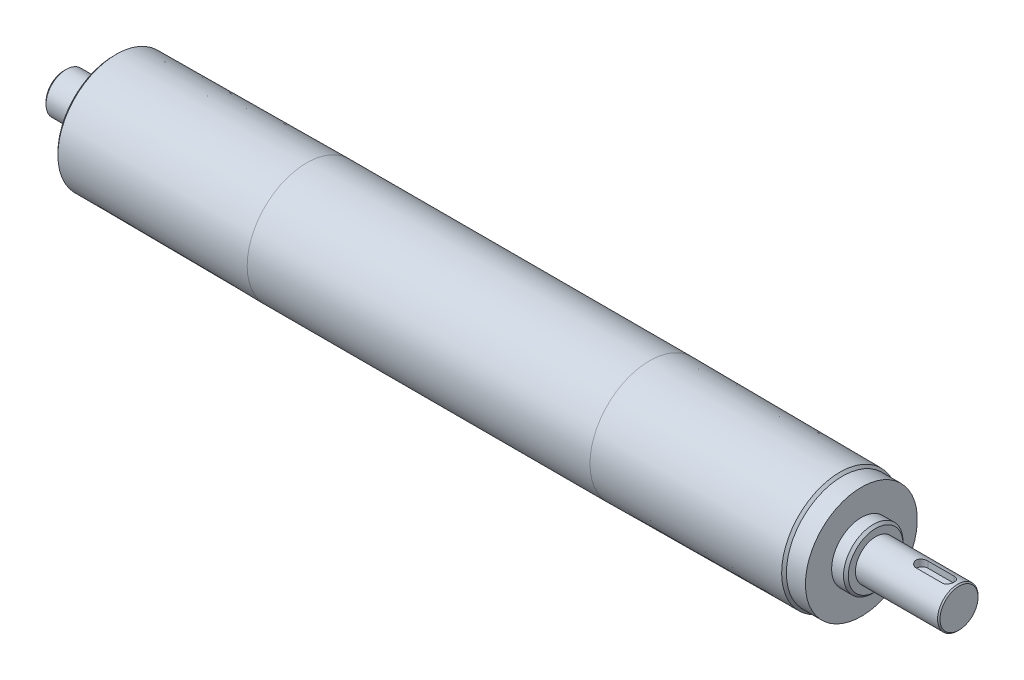
ISO-10303-21;
HEADER;
FILE_DESCRIPTION(('STEP AP214'),'2;1');
FILE_NAME('part.step','',(''),(''),'','','');
FILE_SCHEMA(('AUTOMOTIVE_DESIGN { 1 0 10303 214 1 1 1 1 }'));
ENDSEC;
DATA;
#1=APPLICATION_CONTEXT('core data for automotive mechanical design processes');
#2=APPLICATION_PROTOCOL_DEFINITION('international standard','automotive_design',2000,#1);
#3=PRODUCT_CONTEXT('',#1,'mechanical');
#4=PRODUCT('Part','Part','',(#3));
#5=PRODUCT_RELATED_PRODUCT_CATEGORY('part','',(#4));
#6=PRODUCT_DEFINITION_FORMATION('','',#4);
#7=PRODUCT_DEFINITION_CONTEXT('part definition',#1,'design');
#8=PRODUCT_DEFINITION('design','',#6,#7);
#9=PRODUCT_DEFINITION_SHAPE('','',#8);
#10=(LENGTH_UNIT() NAMED_UNIT(*) SI_UNIT(.MILLI.,.METRE.));
#11=(NAMED_UNIT(*) PLANE_ANGLE_UNIT() SI_UNIT($,.RADIAN.));
#12=(NAMED_UNIT(*) SI_UNIT($,.STERADIAN.) SOLID_ANGLE_UNIT());
#13=UNCERTAINTY_MEASURE_WITH_UNIT(LENGTH_MEASURE(1.E-05),#10,'distance_accuracy_value','');
#14=(GEOMETRIC_REPRESENTATION_CONTEXT(3) GLOBAL_UNCERTAINTY_ASSIGNED_CONTEXT((#13)) GLOBAL_UNIT_ASSIGNED_CONTEXT((#10,
#11,#12)) REPRESENTATION_CONTEXT('',''));
#15=CARTESIAN_POINT('',(0.,0.,0.));
#16=DIRECTION('',(0.,0.,1.));
#17=DIRECTION('',(1.,0.,0.));
#18=AXIS2_PLACEMENT_3D('',#15,#16,#17);
#19=CARTESIAN_POINT('',(-174.,0.,0.));
#20=DIRECTION('',(-1.,0.,0.));
#21=DIRECTION('',(0.,0.,1.));
#22=AXIS2_PLACEMENT_3D('',#19,#20,#21);
#23=CYLINDRICAL_SURFACE('',#22,8.5);
#24=CARTESIAN_POINT('',(201.5,0.,0.));
#25=DIRECTION('',(-1.,0.,0.));
#26=DIRECTION('',(0.,0.,1.));
#27=AXIS2_PLACEMENT_3D('',#24,#25,#26);
#28=CIRCLE('',#27,8.5);
#29=CARTESIAN_POINT('',(201.5,0.,8.5));
#30=VERTEX_POINT('',#29);
#31=EDGE_CURVE('E129',#30,#30,#28,.T.);
#32=ORIENTED_EDGE('',*,*,#31,.T.);
#33=EDGE_LOOP('',(#32));
#34=FACE_BOUND('',#33,.T.);
#35=CARTESIAN_POINT('',(167.,0.,0.));
#36=DIRECTION('',(-1.,0.,0.));
#37=DIRECTION('',(0.,0.,1.));
#38=AXIS2_PLACEMENT_3D('',#35,#36,#37);
#39=CIRCLE('',#38,8.5);
#40=CARTESIAN_POINT('',(167.,0.,8.5));
#41=VERTEX_POINT('',#40);
#42=EDGE_CURVE('E126',#41,#41,#39,.T.);
#43=ORIENTED_EDGE('',*,*,#42,.F.);
#44=EDGE_LOOP('',(#43));
#45=FACE_BOUND('',#44,.T.);
#46=CARTESIAN_POINT('',(186.5,8.12403840463596,-2.5));
#47=CARTESIAN_POINT('',(186.431320125984,8.12402906918787,-2.50000849482375));
#48=CARTESIAN_POINT('',(186.362645644966,8.12490911076693,-2.49717000278527));
#49=CARTESIAN_POINT('',(186.22581945585,8.12837858671625,-2.48586511968106));
#50=CARTESIAN_POINT('',(186.157667637307,8.13096764928693,-2.47739995270244));
#51=CARTESIAN_POINT('',(186.022534814754,8.13777747849977,-2.45493539721691));
#52=CARTESIAN_POINT('',(185.955551343683,8.14199421689239,-2.44094966934029));
#53=CARTESIAN_POINT('',(185.823073877509,8.15192355487623,-2.40758038109889));
#54=CARTESIAN_POINT('',(185.757579918998,8.15763619117327,-2.38819668828001));
#55=CARTESIAN_POINT('',(185.564053342284,8.17677139859334,-2.32218333516284));
#56=CARTESIAN_POINT('',(185.438808855627,8.19220032894026,-2.26766331260792));
#57=CARTESIAN_POINT('',(185.199247499771,8.22665400749432,-2.13928827038699));
#58=CARTESIAN_POINT('',(185.084935474627,8.24568033865687,-2.06542473351159));
#59=CARTESIAN_POINT('',(184.866977246359,8.28582980304435,-1.89805567552887));
#60=CARTESIAN_POINT('',(184.763708544243,8.30699606932741,-1.80406793699747));
#61=CARTESIAN_POINT('',(184.574148769132,8.3486723067775,-1.60015164255656));
#62=CARTESIAN_POINT('',(184.487860541848,8.36918216745792,-1.4902204200766));
#63=CARTESIAN_POINT('',(184.333070185537,8.40772509439061,-1.25484557022576));
#64=CARTESIAN_POINT('',(184.264954141379,8.4257010652051,-1.12913784642327));
#65=CARTESIAN_POINT('',(184.150978008424,8.45664705558545,-0.867439712870076));
#66=CARTESIAN_POINT('',(184.105112355001,8.46961832661637,-0.731451883926542));
#67=CARTESIAN_POINT('',(184.038187402419,8.48878775104764,-0.45702543604255));
#68=CARTESIAN_POINT('',(184.016479434077,8.49516267663223,-0.318757581047526));
#69=CARTESIAN_POINT('',(183.996436833058,8.50104290465192,-0.0404023337326379));
#70=CARTESIAN_POINT('',(183.998097964227,8.50054945212903,0.0996847242177701));
#71=CARTESIAN_POINT('',(184.024307927384,8.49287404903277,0.373152065700674));
#72=CARTESIAN_POINT('',(184.048154187553,8.48589741931878,0.506606351501265));
#73=CARTESIAN_POINT('',(184.116911871628,8.46628787386659,0.767526211609376));
#74=CARTESIAN_POINT('',(184.161824383513,8.45365466599277,0.894991476236457));
#75=CARTESIAN_POINT('',(184.271927116914,8.42386367197651,1.14201050505987));
#76=CARTESIAN_POINT('',(184.337342099129,8.40665607251673,1.26145783196646));
#77=CARTESIAN_POINT('',(184.486415594932,8.36954730631605,1.48790576816495));
#78=CARTESIAN_POINT('',(184.57007803811,8.34964555974157,1.59490368885597));
#79=CARTESIAN_POINT('',(184.756920813167,8.3084133766687,1.7976009216362));
#80=CARTESIAN_POINT('',(184.860708990406,8.28705732485783,1.89273539157046));
#81=CARTESIAN_POINT('',(185.083004056905,8.2459668982496,2.06442395091054));
#82=CARTESIAN_POINT('',(185.201515171381,8.22623299169098,2.14097268784053));
#83=CARTESIAN_POINT('',(185.451351789766,8.19049726651394,2.27388499803612));
#84=CARTESIAN_POINT('',(185.582787458334,8.17453234339792,2.33005169701785));
#85=CARTESIAN_POINT('',(185.853757268301,8.14859211524143,2.41922275200857));
#86=CARTESIAN_POINT('',(185.993278719173,8.13860768891974,2.45226239378341));
#87=CARTESIAN_POINT('',(186.195077579308,8.1295316440969,2.48209216527632));
#88=CARTESIAN_POINT('',(186.255895339122,8.12747604590249,2.48880708529662));
#89=CARTESIAN_POINT('',(186.377798533073,8.12472934803225,2.49775684694221));
#90=CARTESIAN_POINT('',(186.438883429881,8.1240362093203,2.49999838344215));
#91=CARTESIAN_POINT('',(186.5,8.12403840463596,2.5));
#92=B_SPLINE_CURVE_WITH_KNOTS('',3,(#46,#47,#48,#49,#50,#51,#52,#53,#54,#55,#56,#57,#58,#59,#60,
#61,#62,#63,#64,#65,#66,#67,#68,#69,#70,#71,#72,#73,#74,#75,#76,#77,#78,#79,#80,#81,#82,#83,#84,
#85,#86,#87,#88,#89,#90,#91),.UNSPECIFIED.,.F.,.F.,(4,2,2,2,2,2,2,2,2,2,2,2,2,2,2,2,2,2,2,2,2,2,
4),(0.,0.205966154303633,0.411887515184528,0.617302486138767,0.8227224979654,1.23305966556152,
1.64357781480007,2.0653304967558,2.48715379896953,2.91733102657663,3.34740061511648,
3.76562050724645,4.18376458896797,4.58910158908383,4.9944595253604,5.40442657694559,
5.81448200221467,6.23971616695716,6.66507264934229,7.09443475825321,7.52314033790763,
7.70665727258008,7.88989934885716),.UNSPECIFIED.);
#93=CARTESIAN_POINT('',(186.5,8.12403840463596,-2.5));
#94=VERTEX_POINT('',#93);
#95=CARTESIAN_POINT('',(186.5,8.12403840463596,2.5));
#96=VERTEX_POINT('',#95);
#97=EDGE_CURVE('E11',#94,#96,#92,.T.);
#98=ORIENTED_EDGE('',*,*,#97,.F.);
#99=DIRECTION('',(-1.,0.,0.));
#100=VECTOR('',#99,1.);
#101=CARTESIAN_POINT('',(-174.,8.12403840463597,-2.49999999999997));
#102=LINE('',#101,#100);
#103=CARTESIAN_POINT('',(197.5,8.12403840463597,-2.49999999999997));
#104=VERTEX_POINT('',#103);
#105=EDGE_CURVE('E159',#104,#94,#102,.T.);
#106=ORIENTED_EDGE('',*,*,#105,.F.);
#107=CARTESIAN_POINT('',(197.5,8.12403840463596,2.5));
#108=CARTESIAN_POINT('',(197.568679874016,8.12402906918787,2.50000849482375));
#109=CARTESIAN_POINT('',(197.637354355034,8.12490911076693,2.49717000278527));
#110=CARTESIAN_POINT('',(197.77418054415,8.12837858671625,2.48586511968106));
#111=CARTESIAN_POINT('',(197.842332362693,8.13096764928694,2.47739995270244));
#112=CARTESIAN_POINT('',(197.977465185246,8.13777747849977,2.45493539721691));
#113=CARTESIAN_POINT('',(198.044448656317,8.14199421689239,2.44094966934029));
#114=CARTESIAN_POINT('',(198.176926122491,8.15192355487623,2.40758038109888));
#115=CARTESIAN_POINT('',(198.242420081002,8.15763619117327,2.38819668828));
#116=CARTESIAN_POINT('',(198.435946657716,8.17677139859334,2.32218333516283));
#117=CARTESIAN_POINT('',(198.561191144373,8.19220032894026,2.26766331260791));
#118=CARTESIAN_POINT('',(198.800752500229,8.22665400749432,2.13928827038698));
#119=CARTESIAN_POINT('',(198.915064525374,8.24568033865688,2.06542473351157));
#120=CARTESIAN_POINT('',(199.133022753641,8.28582980304436,1.89805567552885));
#121=CARTESIAN_POINT('',(199.236291455757,8.30699606932742,1.80406793699744));
#122=CARTESIAN_POINT('',(199.425851230868,8.3486723067775,1.60015164255652));
#123=CARTESIAN_POINT('',(199.512139458152,8.36918216745793,1.49022042007658));
#124=CARTESIAN_POINT('',(199.666929814463,8.40772509439061,1.25484557022573));
#125=CARTESIAN_POINT('',(199.735045858621,8.42570106520511,1.12913784642323));
#126=CARTESIAN_POINT('',(199.849021991576,8.45664705558546,0.867439712870024));
#127=CARTESIAN_POINT('',(199.894887644999,8.46961832661638,0.731451883926489));
#128=CARTESIAN_POINT('',(199.961812597581,8.48878775104765,0.457025436042501));
#129=CARTESIAN_POINT('',(199.983520565923,8.49516267663223,0.318757581047481));
#130=CARTESIAN_POINT('',(200.003563166942,8.50104290465192,0.0404023337326006));
#131=CARTESIAN_POINT('',(200.001902035773,8.50054945212903,-0.099684724217803));
#132=CARTESIAN_POINT('',(199.975692072616,8.49287404903277,-0.373152065700703));
#133=CARTESIAN_POINT('',(199.951845812447,8.48589741931878,-0.506606351501293));
#134=CARTESIAN_POINT('',(199.883088128372,8.46628787386658,-0.767526211609402));
#135=CARTESIAN_POINT('',(199.838175616487,8.45365466599277,-0.894991476236481));
#136=CARTESIAN_POINT('',(199.728072883086,8.42386367197651,-1.14201050505989));
#137=CARTESIAN_POINT('',(199.662657900871,8.40665607251673,-1.2614578319665));
#138=CARTESIAN_POINT('',(199.513584405068,8.36954730631604,-1.48790576816498));
#139=CARTESIAN_POINT('',(199.42992196189,8.34964555974157,-1.59490368885599));
#140=CARTESIAN_POINT('',(199.243079186833,8.3084133766687,-1.79760092163622));
#141=CARTESIAN_POINT('',(199.139291009594,8.28705732485783,-1.89273539157049));
#142=CARTESIAN_POINT('',(198.916995943095,8.24596689824959,-2.06442395091057));
#143=CARTESIAN_POINT('',(198.798484828619,8.22623299169097,-2.14097268784054));
#144=CARTESIAN_POINT('',(198.548648210234,8.19049726651393,-2.27388499803613));
#145=CARTESIAN_POINT('',(198.417212541666,8.17453234339792,-2.33005169701786));
#146=CARTESIAN_POINT('',(198.146242731699,8.14859211524143,-2.41922275200858));
#147=CARTESIAN_POINT('',(198.006721280827,8.13860768891974,-2.45226239378342));
#148=CARTESIAN_POINT('',(197.804922420692,8.1295316440969,-2.48209216527632));
#149=CARTESIAN_POINT('',(197.744104660878,8.12747604590249,-2.48880708529662));
#150=CARTESIAN_POINT('',(197.622201466927,8.12472934803225,-2.49775684694221));
#151=CARTESIAN_POINT('',(197.561116570119,8.1240362093203,-2.49999838344215));
#152=CARTESIAN_POINT('',(197.5,8.12403840463596,-2.5));
#153=B_SPLINE_CURVE_WITH_KNOTS('',3,(#107,#108,#109,#110,#111,#112,#113,#114,#115,#116,#117,
#118,#119,#120,#121,#122,#123,#124,#125,#126,#127,#128,#129,#130,#131,#132,#133,#134,#135,#136,
#137,#138,#139,#140,#141,#142,#143,#144,#145,#146,#147,#148,#149,#150,#151,#152),.UNSPECIFIED.,
.F.,.F.,(4,2,2,2,2,2,2,2,2,2,2,2,2,2,2,2,2,2,2,2,2,2,4),(0.,0.205966154303661,0.411887515184529,
0.617302486138768,0.822722497965402,1.23305966556152,1.64357781480007,2.06533049675582,
2.48715379896953,2.91733102657666,3.34740061511652,3.76562050724647,4.18376458896798,
4.58910158908384,4.9944595253604,5.4044265769456,5.81448200221469,6.23971616695719,
6.66507264934228,7.09443475825323,7.52314033790765,7.70665727258007,7.88989934885715),.UNSPECIFIED.);
#154=CARTESIAN_POINT('',(197.5,8.12403840463596,2.5));
#155=VERTEX_POINT('',#154);
#156=EDGE_CURVE('E161',#155,#104,#153,.T.);
#157=ORIENTED_EDGE('',*,*,#156,.F.);
#158=DIRECTION('',(-1.,0.,0.));
#159=VECTOR('',#158,1.);
#160=CARTESIAN_POINT('',(-174.,8.12403840463597,2.49999999999997));
#161=LINE('',#160,#159);
#162=EDGE_CURVE('E43',#96,#155,#161,.F.);
#163=ORIENTED_EDGE('',*,*,#162,.F.);
#164=EDGE_LOOP('',(#98,#106,#157,#163));
#165=FACE_BOUND('',#164,.T.);
#166=ADVANCED_FACE('F30',(#34,#45,#165),#23,.T.);
#167=CARTESIAN_POINT('',(-72.,0.,0.));
#168=DIRECTION('',(1.,0.,0.));
#169=DIRECTION('',(0.,0.,-1.));
#170=AXIS2_PLACEMENT_3D('',#167,#168,#169);
#171=CONICAL_SURFACE('',#170,25.,0.00624991862169927);
#172=CARTESIAN_POINT('',(-152.,0.,0.));
#173=DIRECTION('',(-1.,0.,0.));
#174=DIRECTION('',(0.,0.,1.));
#175=AXIS2_PLACEMENT_3D('',#172,#173,#174);
#176=CIRCLE('',#175,24.5);
#177=CARTESIAN_POINT('',(-152.,0.,24.5));
#178=VERTEX_POINT('',#177);
#179=EDGE_CURVE('E156',#178,#178,#176,.T.);
#180=ORIENTED_EDGE('',*,*,#179,.F.);
#181=EDGE_LOOP('',(#180));
#182=FACE_BOUND('',#181,.T.);
#183=CARTESIAN_POINT('',(-72.,0.,0.));
#184=DIRECTION('',(-1.,0.,0.));
#185=DIRECTION('',(0.,0.,1.));
#186=AXIS2_PLACEMENT_3D('',#183,#184,#185);
#187=CIRCLE('',#186,25.);
#188=CARTESIAN_POINT('',(-72.,0.,25.));
#189=VERTEX_POINT('',#188);
#190=EDGE_CURVE('E80',#189,#189,#187,.T.);
#191=ORIENTED_EDGE('',*,*,#190,.T.);
#192=EDGE_LOOP('',(#191));
#193=FACE_BOUND('',#192,.T.);
#194=ADVANCED_FACE('F32',(#182,#193),#171,.T.);
#195=CARTESIAN_POINT('',(-152.,0.,0.));
#196=DIRECTION('',(1.,0.,0.));
#197=DIRECTION('',(0.,0.,-1.));
#198=AXIS2_PLACEMENT_3D('',#195,#196,#197);
#199=CONICAL_SURFACE('',#198,24.5,0.785398163397459);
#200=CARTESIAN_POINT('',(-153.,0.,0.));
#201=DIRECTION('',(-1.,0.,0.));
#202=DIRECTION('',(0.,0.,1.));
#203=AXIS2_PLACEMENT_3D('',#200,#201,#202);
#204=CIRCLE('',#203,23.5);
#205=CARTESIAN_POINT('',(-153.,0.,23.5));
#206=VERTEX_POINT('',#205);
#207=EDGE_CURVE('E153',#206,#206,#204,.T.);
#208=ORIENTED_EDGE('',*,*,#207,.F.);
#209=EDGE_LOOP('',(#208));
#210=FACE_BOUND('',#209,.T.);
#211=ORIENTED_EDGE('',*,*,#179,.T.);
#212=EDGE_LOOP('',(#211));
#213=FACE_BOUND('',#212,.T.);
#214=ADVANCED_FACE('F224',(#210,#213),#199,.T.);
#215=CARTESIAN_POINT('',(-153.,0.,-23.5));
#216=DIRECTION('',(1.,0.,0.));
#217=DIRECTION('',(0.,0.,-1.));
#218=AXIS2_PLACEMENT_3D('',#215,#216,#217);
#219=PLANE('',#218);
#220=CARTESIAN_POINT('',(-153.,0.,0.));
#221=DIRECTION('',(-1.,0.,0.));
#222=DIRECTION('',(0.,0.,1.));
#223=AXIS2_PLACEMENT_3D('',#220,#221,#222);
#224=CIRCLE('',#223,12.5);
#225=CARTESIAN_POINT('',(-153.,0.,12.5));
#226=VERTEX_POINT('',#225);
#227=EDGE_CURVE('E150',#226,#226,#224,.T.);
#228=ORIENTED_EDGE('',*,*,#227,.F.);
#229=EDGE_LOOP('',(#228));
#230=FACE_BOUND('',#229,.T.);
#231=ORIENTED_EDGE('',*,*,#207,.T.);
#232=EDGE_LOOP('',(#231));
#233=FACE_BOUND('',#232,.T.);
#234=ADVANCED_FACE('F385',(#230,#233),#219,.F.);
#235=CARTESIAN_POINT('',(-174.,0.,0.));
#236=DIRECTION('',(-1.,0.,0.));
#237=DIRECTION('',(0.,0.,1.));
#238=AXIS2_PLACEMENT_3D('',#235,#236,#237);
#239=CYLINDRICAL_SURFACE('',#238,12.5);
#240=CARTESIAN_POINT('',(-157.,0.,0.));
#241=DIRECTION('',(-1.,0.,0.));
#242=DIRECTION('',(0.,0.,1.));
#243=AXIS2_PLACEMENT_3D('',#240,#241,#242);
#244=CIRCLE('',#243,12.5);
#245=CARTESIAN_POINT('',(-157.,0.,12.5));
#246=VERTEX_POINT('',#245);
#247=EDGE_CURVE('E147',#246,#246,#244,.T.);
#248=ORIENTED_EDGE('',*,*,#247,.F.);
#249=EDGE_LOOP('',(#248));
#250=FACE_BOUND('',#249,.T.);
#251=ORIENTED_EDGE('',*,*,#227,.T.);
#252=EDGE_LOOP('',(#251));
#253=FACE_BOUND('',#252,.T.);
#254=ADVANCED_FACE('F375',(#250,#253),#239,.T.);
#255=CARTESIAN_POINT('',(-157.,0.,0.));
#256=DIRECTION('',(1.,0.,0.));
#257=DIRECTION('',(0.,0.,-1.));
#258=AXIS2_PLACEMENT_3D('',#255,#256,#257);
#259=CONICAL_SURFACE('',#258,12.5,0.78539816339745);
#260=CARTESIAN_POINT('',(-158.,0.,0.));
#261=DIRECTION('',(-1.,0.,0.));
#262=DIRECTION('',(0.,0.,1.));
#263=AXIS2_PLACEMENT_3D('',#260,#261,#262);
#264=CIRCLE('',#263,11.5);
#265=CARTESIAN_POINT('',(-158.,0.,11.5));
#266=VERTEX_POINT('',#265);
#267=EDGE_CURVE('E144',#266,#266,#264,.T.);
#268=ORIENTED_EDGE('',*,*,#267,.F.);
#269=EDGE_LOOP('',(#268));
#270=FACE_BOUND('',#269,.T.);
#271=ORIENTED_EDGE('',*,*,#247,.T.);
#272=EDGE_LOOP('',(#271));
#273=FACE_BOUND('',#272,.T.);
#274=ADVANCED_FACE('F365',(#270,#273),#259,.T.);
#275=CARTESIAN_POINT('',(-158.,0.,-11.5));
#276=DIRECTION('',(1.,0.,0.));
#277=DIRECTION('',(0.,0.,-1.));
#278=AXIS2_PLACEMENT_3D('',#275,#276,#277);
#279=PLANE('',#278);
#280=CARTESIAN_POINT('',(-158.,0.,0.));
#281=DIRECTION('',(-1.,0.,0.));
#282=DIRECTION('',(0.,0.,1.));
#283=AXIS2_PLACEMENT_3D('',#280,#281,#282);
#284=CIRCLE('',#283,8.5);
#285=CARTESIAN_POINT('',(-158.,0.,8.5));
#286=VERTEX_POINT('',#285);
#287=EDGE_CURVE('E141',#286,#286,#284,.T.);
#288=ORIENTED_EDGE('',*,*,#287,.F.);
#289=EDGE_LOOP('',(#288));
#290=FACE_BOUND('',#289,.T.);
#291=ORIENTED_EDGE('',*,*,#267,.T.);
#292=EDGE_LOOP('',(#291));
#293=FACE_BOUND('',#292,.T.);
#294=ADVANCED_FACE('F355',(#290,#293),#279,.F.);
#295=CARTESIAN_POINT('',(-174.,0.,0.));
#296=DIRECTION('',(-1.,0.,0.));
#297=DIRECTION('',(0.,0.,1.));
#298=AXIS2_PLACEMENT_3D('',#295,#296,#297);
#299=CYLINDRICAL_SURFACE('',#298,8.5);
#300=CARTESIAN_POINT('',(-173.,0.,0.));
#301=DIRECTION('',(-1.,0.,0.));
#302=DIRECTION('',(0.,0.,1.));
#303=AXIS2_PLACEMENT_3D('',#300,#301,#302);
#304=CIRCLE('',#303,8.49999999999999);
#305=CARTESIAN_POINT('',(-173.,0.,8.49999999999999));
#306=VERTEX_POINT('',#305);
#307=EDGE_CURVE('E138',#306,#306,#304,.T.);
#308=ORIENTED_EDGE('',*,*,#307,.F.);
#309=EDGE_LOOP('',(#308));
#310=FACE_BOUND('',#309,.T.);
#311=ORIENTED_EDGE('',*,*,#287,.T.);
#312=EDGE_LOOP('',(#311));
#313=FACE_BOUND('',#312,.T.);
#314=ADVANCED_FACE('F345',(#310,#313),#299,.T.);
#315=CARTESIAN_POINT('',(-173.,0.,0.));
#316=DIRECTION('',(1.,0.,0.));
#317=DIRECTION('',(0.,0.,-1.));
#318=AXIS2_PLACEMENT_3D('',#315,#316,#317);
#319=CONICAL_SURFACE('',#318,8.49999999999999,0.785398163397458);
#320=CARTESIAN_POINT('',(-174.,0.,0.));
#321=DIRECTION('',(-1.,0.,0.));
#322=DIRECTION('',(0.,0.,1.));
#323=AXIS2_PLACEMENT_3D('',#320,#321,#322);
#324=CIRCLE('',#323,7.49999999999998);
#325=CARTESIAN_POINT('',(-174.,0.,7.49999999999998));
#326=VERTEX_POINT('',#325);
#327=EDGE_CURVE('E135',#326,#326,#324,.T.);
#328=ORIENTED_EDGE('',*,*,#327,.F.);
#329=EDGE_LOOP('',(#328));
#330=FACE_BOUND('',#329,.T.);
#331=ORIENTED_EDGE('',*,*,#307,.T.);
#332=EDGE_LOOP('',(#331));
#333=FACE_BOUND('',#332,.T.);
#334=ADVANCED_FACE('F335',(#330,#333),#319,.T.);
#335=CARTESIAN_POINT('',(-174.,0.,-7.49999999999998));
#336=DIRECTION('',(1.,0.,0.));
#337=DIRECTION('',(0.,0.,-1.));
#338=AXIS2_PLACEMENT_3D('',#335,#336,#337);
#339=PLANE('',#338);
#340=ORIENTED_EDGE('',*,*,#327,.T.);
#341=EDGE_LOOP('',(#340));
#342=FACE_BOUND('',#341,.T.);
#343=ADVANCED_FACE('F325',(#342),#339,.F.);
#344=CARTESIAN_POINT('',(202.,0.,-8.));
#345=DIRECTION('',(-1.,0.,0.));
#346=DIRECTION('',(0.,0.,1.));
#347=AXIS2_PLACEMENT_3D('',#344,#345,#346);
#348=PLANE('',#347);
#349=CARTESIAN_POINT('',(202.,0.,0.));
#350=DIRECTION('',(-1.,0.,0.));
#351=DIRECTION('',(0.,0.,1.));
#352=AXIS2_PLACEMENT_3D('',#349,#350,#351);
#353=CIRCLE('',#352,8.);
#354=CARTESIAN_POINT('',(202.,0.,8.));
#355=VERTEX_POINT('',#354);
#356=EDGE_CURVE('E132',#355,#355,#353,.T.);
#357=ORIENTED_EDGE('',*,*,#356,.F.);
#358=EDGE_LOOP('',(#357));
#359=FACE_BOUND('',#358,.T.);
#360=ADVANCED_FACE('F215',(#359),#348,.F.);
#361=CARTESIAN_POINT('',(202.,0.,0.));
#362=DIRECTION('',(-1.,0.,0.));
#363=DIRECTION('',(0.,0.,1.));
#364=AXIS2_PLACEMENT_3D('',#361,#362,#363);
#365=CONICAL_SURFACE('',#364,8.,0.785398163397452);
#366=ORIENTED_EDGE('',*,*,#31,.F.);
#367=EDGE_LOOP('',(#366));
#368=FACE_BOUND('',#367,.T.);
#369=ORIENTED_EDGE('',*,*,#356,.T.);
#370=EDGE_LOOP('',(#369));
#371=FACE_BOUND('',#370,.T.);
#372=ADVANCED_FACE('F210',(#368,#371),#365,.T.);
#373=CARTESIAN_POINT('',(167.,0.,-11.5));
#374=DIRECTION('',(-1.,0.,0.));
#375=DIRECTION('',(0.,0.,1.));
#376=AXIS2_PLACEMENT_3D('',#373,#374,#375);
#377=PLANE('',#376);
#378=CARTESIAN_POINT('',(167.,0.,0.));
#379=DIRECTION('',(-1.,0.,0.));
#380=DIRECTION('',(0.,0.,1.));
#381=AXIS2_PLACEMENT_3D('',#378,#379,#380);
#382=CIRCLE('',#381,11.5);
#383=CARTESIAN_POINT('',(167.,0.,11.5));
#384=VERTEX_POINT('',#383);
#385=EDGE_CURVE('E123',#384,#384,#382,.T.);
#386=ORIENTED_EDGE('',*,*,#385,.F.);
#387=EDGE_LOOP('',(#386));
#388=FACE_BOUND('',#387,.T.);
#389=ORIENTED_EDGE('',*,*,#42,.T.);
#390=EDGE_LOOP('',(#389));
#391=FACE_BOUND('',#390,.T.);
#392=ADVANCED_FACE('F207',(#388,#391),#377,.F.);
#393=CARTESIAN_POINT('',(167.,0.,0.));
#394=DIRECTION('',(-1.,0.,0.));
#395=DIRECTION('',(0.,0.,1.));
#396=AXIS2_PLACEMENT_3D('',#393,#394,#395);
#397=CONICAL_SURFACE('',#396,11.5,0.78539816339745);
#398=CARTESIAN_POINT('',(166.,0.,0.));
#399=DIRECTION('',(-1.,0.,0.));
#400=DIRECTION('',(0.,0.,1.));
#401=AXIS2_PLACEMENT_3D('',#398,#399,#400);
#402=CIRCLE('',#401,12.5);
#403=CARTESIAN_POINT('',(166.,0.,12.5));
#404=VERTEX_POINT('',#403);
#405=EDGE_CURVE('E120',#404,#404,#402,.T.);
#406=ORIENTED_EDGE('',*,*,#405,.F.);
#407=EDGE_LOOP('',(#406));
#408=FACE_BOUND('',#407,.T.);
#409=ORIENTED_EDGE('',*,*,#385,.T.);
#410=EDGE_LOOP('',(#409));
#411=FACE_BOUND('',#410,.T.);
#412=ADVANCED_FACE('F204',(#408,#411),#397,.T.);
#413=CARTESIAN_POINT('',(-174.,0.,0.));
#414=DIRECTION('',(-1.,0.,0.));
#415=DIRECTION('',(0.,0.,1.));
#416=AXIS2_PLACEMENT_3D('',#413,#414,#415);
#417=CYLINDRICAL_SURFACE('',#416,12.5);
#418=CARTESIAN_POINT('',(161.,0.,0.));
#419=DIRECTION('',(-1.,0.,0.));
#420=DIRECTION('',(0.,0.,1.));
#421=AXIS2_PLACEMENT_3D('',#418,#419,#420);
#422=CIRCLE('',#421,12.5);
#423=CARTESIAN_POINT('',(161.,0.,12.5));
#424=VERTEX_POINT('',#423);
#425=EDGE_CURVE('E117',#424,#424,#422,.T.);
#426=ORIENTED_EDGE('',*,*,#425,.F.);
#427=EDGE_LOOP('',(#426));
#428=FACE_BOUND('',#427,.T.);
#429=ORIENTED_EDGE('',*,*,#405,.T.);
#430=EDGE_LOOP('',(#429));
#431=FACE_BOUND('',#430,.T.);
#432=ADVANCED_FACE('F200',(#428,#431),#417,.T.);
#433=CARTESIAN_POINT('',(161.,0.,-23.5));
#434=DIRECTION('',(-1.,0.,0.));
#435=DIRECTION('',(0.,0.,1.));
#436=AXIS2_PLACEMENT_3D('',#433,#434,#435);
#437=PLANE('',#436);
#438=CARTESIAN_POINT('',(161.,0.,0.));
#439=DIRECTION('',(-1.,0.,0.));
#440=DIRECTION('',(0.,0.,1.));
#441=AXIS2_PLACEMENT_3D('',#438,#439,#440);
#442=CIRCLE('',#441,23.5);
#443=CARTESIAN_POINT('',(161.,0.,23.5));
#444=VERTEX_POINT('',#443);
#445=EDGE_CURVE('E114',#444,#444,#442,.T.);
#446=ORIENTED_EDGE('',*,*,#445,.F.);
#447=EDGE_LOOP('',(#446));
#448=FACE_BOUND('',#447,.T.);
#449=ORIENTED_EDGE('',*,*,#425,.T.);
#450=EDGE_LOOP('',(#449));
#451=FACE_BOUND('',#450,.T.);
#452=ADVANCED_FACE('F196',(#448,#451),#437,.F.);
#453=CARTESIAN_POINT('',(-174.,0.,0.));
#454=DIRECTION('',(-1.,0.,0.));
#455=DIRECTION('',(0.,0.,1.));
#456=AXIS2_PLACEMENT_3D('',#453,#454,#455);
#457=CYLINDRICAL_SURFACE('',#456,23.5);
#458=CARTESIAN_POINT('',(153.,0.,0.));
#459=DIRECTION('',(-1.,0.,0.));
#460=DIRECTION('',(0.,0.,1.));
#461=AXIS2_PLACEMENT_3D('',#458,#459,#460);
#462=CIRCLE('',#461,23.5);
#463=CARTESIAN_POINT('',(153.,0.,23.5));
#464=VERTEX_POINT('',#463);
#465=EDGE_CURVE('E111',#464,#464,#462,.T.);
#466=ORIENTED_EDGE('',*,*,#465,.F.);
#467=EDGE_LOOP('',(#466));
#468=FACE_BOUND('',#467,.T.);
#469=ORIENTED_EDGE('',*,*,#445,.T.);
#470=EDGE_LOOP('',(#469));
#471=FACE_BOUND('',#470,.T.);
#472=ADVANCED_FACE('F192',(#468,#471),#457,.T.);
#473=CARTESIAN_POINT('',(153.,0.,0.));
#474=DIRECTION('',(-1.,0.,0.));
#475=DIRECTION('',(0.,0.,1.));
#476=AXIS2_PLACEMENT_3D('',#473,#474,#475);
#477=CONICAL_SURFACE('',#476,23.5,0.78539816339745);
#478=CARTESIAN_POINT('',(152.,0.,0.));
#479=DIRECTION('',(-1.,0.,0.));
#480=DIRECTION('',(0.,0.,1.));
#481=AXIS2_PLACEMENT_3D('',#478,#479,#480);
#482=CIRCLE('',#481,24.5);
#483=CARTESIAN_POINT('',(152.,0.,24.5));
#484=VERTEX_POINT('',#483);
#485=EDGE_CURVE('E108',#484,#484,#482,.T.);
#486=ORIENTED_EDGE('',*,*,#485,.F.);
#487=EDGE_LOOP('',(#486));
#488=FACE_BOUND('',#487,.T.);
#489=ORIENTED_EDGE('',*,*,#465,.T.);
#490=EDGE_LOOP('',(#489));
#491=FACE_BOUND('',#490,.T.);
#492=ADVANCED_FACE('F188',(#488,#491),#477,.T.);
#493=CARTESIAN_POINT('',(152.,0.,0.));
#494=DIRECTION('',(-1.,0.,0.));
#495=DIRECTION('',(0.,0.,1.));
#496=AXIS2_PLACEMENT_3D('',#493,#494,#495);
#497=CONICAL_SURFACE('',#496,24.5,0.00624991862169858);
#498=CARTESIAN_POINT('',(72.,0.,0.));
#499=DIRECTION('',(-1.,0.,0.));
#500=DIRECTION('',(0.,0.,1.));
#501=AXIS2_PLACEMENT_3D('',#498,#499,#500);
#502=CIRCLE('',#501,25.);
#503=CARTESIAN_POINT('',(72.,0.,25.));
#504=VERTEX_POINT('',#503);
#505=EDGE_CURVE('E105',#504,#504,#502,.T.);
#506=ORIENTED_EDGE('',*,*,#505,.F.);
#507=EDGE_LOOP('',(#506));
#508=FACE_BOUND('',#507,.T.);
#509=ORIENTED_EDGE('',*,*,#485,.T.);
#510=EDGE_LOOP('',(#509));
#511=FACE_BOUND('',#510,.T.);
#512=ADVANCED_FACE('F184',(#508,#511),#497,.T.);
#513=CARTESIAN_POINT('',(-174.,0.,0.));
#514=DIRECTION('',(-1.,0.,0.));
#515=DIRECTION('',(0.,0.,1.));
#516=AXIS2_PLACEMENT_3D('',#513,#514,#515);
#517=CYLINDRICAL_SURFACE('',#516,25.);
#518=ORIENTED_EDGE('',*,*,#190,.F.);
#519=EDGE_LOOP('',(#518));
#520=FACE_BOUND('',#519,.T.);
#521=ORIENTED_EDGE('',*,*,#505,.T.);
#522=EDGE_LOOP('',(#521));
#523=FACE_BOUND('',#522,.T.);
#524=ADVANCED_FACE('F181',(#520,#523),#517,.T.);
#525=CARTESIAN_POINT('',(186.5,155.5,0.));
#526=DIRECTION('',(0.,-1.,0.));
#527=DIRECTION('',(0.,0.,-1.));
#528=AXIS2_PLACEMENT_3D('',#525,#526,#527);
#529=CYLINDRICAL_SURFACE('',#528,2.5);
#530=ORIENTED_EDGE('',*,*,#97,.T.);
#531=DIRECTION('',(0.,-1.,0.));
#532=VECTOR('',#531,1.);
#533=CARTESIAN_POINT('',(186.5,155.5,2.5));
#534=LINE('',#533,#532);
#535=CARTESIAN_POINT('',(186.5,5.5,2.5));
#536=VERTEX_POINT('',#535);
#537=EDGE_CURVE('E73',#96,#536,#534,.T.);
#538=ORIENTED_EDGE('',*,*,#537,.T.);
#539=CARTESIAN_POINT('',(186.5,5.5,0.));
#540=DIRECTION('',(0.,1.,0.));
#541=DIRECTION('',(0.,0.,1.));
#542=AXIS2_PLACEMENT_3D('',#539,#540,#541);
#543=CIRCLE('',#542,2.5);
#544=CARTESIAN_POINT('',(186.5,5.5,-2.5));
#545=VERTEX_POINT('',#544);
#546=EDGE_CURVE('E77',#545,#536,#543,.T.);
#547=ORIENTED_EDGE('',*,*,#546,.F.);
#548=DIRECTION('',(0.,-1.,0.));
#549=VECTOR('',#548,1.);
#550=CARTESIAN_POINT('',(186.5,155.5,-2.5));
#551=LINE('',#550,#549);
#552=EDGE_CURVE('E99',#94,#545,#551,.T.);
#553=ORIENTED_EDGE('',*,*,#552,.F.);
#554=EDGE_LOOP('',(#530,#538,#547,#553));
#555=FACE_BOUND('',#554,.T.);
#556=ADVANCED_FACE('F75',(#555),#529,.F.);
#557=CARTESIAN_POINT('',(197.5,155.5,2.5));
#558=DIRECTION('',(0.,0.,-1.));
#559=DIRECTION('',(-1.,0.,0.));
#560=AXIS2_PLACEMENT_3D('',#557,#558,#559);
#561=PLANE('',#560);
#562=ORIENTED_EDGE('',*,*,#162,.T.);
#563=DIRECTION('',(0.,-1.,0.));
#564=VECTOR('',#563,1.);
#565=CARTESIAN_POINT('',(197.5,155.5,2.5));
#566=LINE('',#565,#564);
#567=CARTESIAN_POINT('',(197.5,5.5,2.5));
#568=VERTEX_POINT('',#567);
#569=EDGE_CURVE('E81',#155,#568,#566,.T.);
#570=ORIENTED_EDGE('',*,*,#569,.T.);
#571=DIRECTION('',(1.,0.,0.));
#572=VECTOR('',#571,1.);
#573=CARTESIAN_POINT('',(197.5,5.5,2.5));
#574=LINE('',#573,#572);
#575=EDGE_CURVE('E84',#536,#568,#574,.T.);
#576=ORIENTED_EDGE('',*,*,#575,.F.);
#577=ORIENTED_EDGE('',*,*,#537,.F.);
#578=EDGE_LOOP('',(#562,#570,#576,#577));
#579=FACE_BOUND('',#578,.T.);
#580=ADVANCED_FACE('F85',(#579),#561,.T.);
#581=CARTESIAN_POINT('',(197.5,155.5,0.));
#582=DIRECTION('',(0.,-1.,0.));
#583=DIRECTION('',(0.,0.,-1.));
#584=AXIS2_PLACEMENT_3D('',#581,#582,#583);
#585=CYLINDRICAL_SURFACE('',#584,2.5);
#586=ORIENTED_EDGE('',*,*,#156,.T.);
#587=DIRECTION('',(0.,-1.,0.));
#588=VECTOR('',#587,1.);
#589=CARTESIAN_POINT('',(197.5,155.5,-2.5));
#590=LINE('',#589,#588);
#591=CARTESIAN_POINT('',(197.5,5.5,-2.5));
#592=VERTEX_POINT('',#591);
#593=EDGE_CURVE('E50',#104,#592,#590,.T.);
#594=ORIENTED_EDGE('',*,*,#593,.T.);
#595=CARTESIAN_POINT('',(197.5,5.5,0.));
#596=DIRECTION('',(0.,1.,0.));
#597=DIRECTION('',(0.,0.,1.));
#598=AXIS2_PLACEMENT_3D('',#595,#596,#597);
#599=CIRCLE('',#598,2.5);
#600=EDGE_CURVE('E90',#568,#592,#599,.T.);
#601=ORIENTED_EDGE('',*,*,#600,.F.);
#602=ORIENTED_EDGE('',*,*,#569,.F.);
#603=EDGE_LOOP('',(#586,#594,#601,#602));
#604=FACE_BOUND('',#603,.T.);
#605=ADVANCED_FACE('F169',(#604),#585,.F.);
#606=CARTESIAN_POINT('',(197.5,155.5,-2.5));
#607=DIRECTION('',(0.,0.,1.));
#608=DIRECTION('',(1.,0.,0.));
#609=AXIS2_PLACEMENT_3D('',#606,#607,#608);
#610=PLANE('',#609);
#611=ORIENTED_EDGE('',*,*,#105,.T.);
#612=ORIENTED_EDGE('',*,*,#552,.T.);
#613=DIRECTION('',(-1.,0.,0.));
#614=VECTOR('',#613,1.);
#615=CARTESIAN_POINT('',(197.5,5.5,-2.5));
#616=LINE('',#615,#614);
#617=EDGE_CURVE('E94',#592,#545,#616,.T.);
#618=ORIENTED_EDGE('',*,*,#617,.F.);
#619=ORIENTED_EDGE('',*,*,#593,.F.);
#620=EDGE_LOOP('',(#611,#612,#618,#619));
#621=FACE_BOUND('',#620,.T.);
#622=ADVANCED_FACE('F174',(#621),#610,.T.);
#623=CARTESIAN_POINT('',(186.5,5.5,0.));
#624=DIRECTION('',(0.,1.,0.));
#625=DIRECTION('',(0.,0.,1.));
#626=AXIS2_PLACEMENT_3D('',#623,#624,#625);
#627=PLANE('',#626);
#628=ORIENTED_EDGE('',*,*,#546,.T.);
#629=ORIENTED_EDGE('',*,*,#575,.T.);
#630=ORIENTED_EDGE('',*,*,#600,.T.);
#631=ORIENTED_EDGE('',*,*,#617,.T.);
#632=EDGE_LOOP('',(#628,#629,#630,#631));
#633=FACE_BOUND('',#632,.T.);
#634=ADVANCED_FACE('F93',(#633),#627,.T.);
#635=CLOSED_SHELL('',(#166,#194,#214,#234,#254,#274,#294,#314,#334,#343,#360,#372,#392,#412,
#432,#452,#472,#492,#512,#524,#556,#580,#605,#622,#634));
#636=MANIFOLD_SOLID_BREP('B2',#635);
#637=ADVANCED_BREP_SHAPE_REPRESENTATION('',(#18,#636),#14);
#638=SHAPE_DEFINITION_REPRESENTATION(#9,#637);
ENDSEC;
END-ISO-10303-21;
